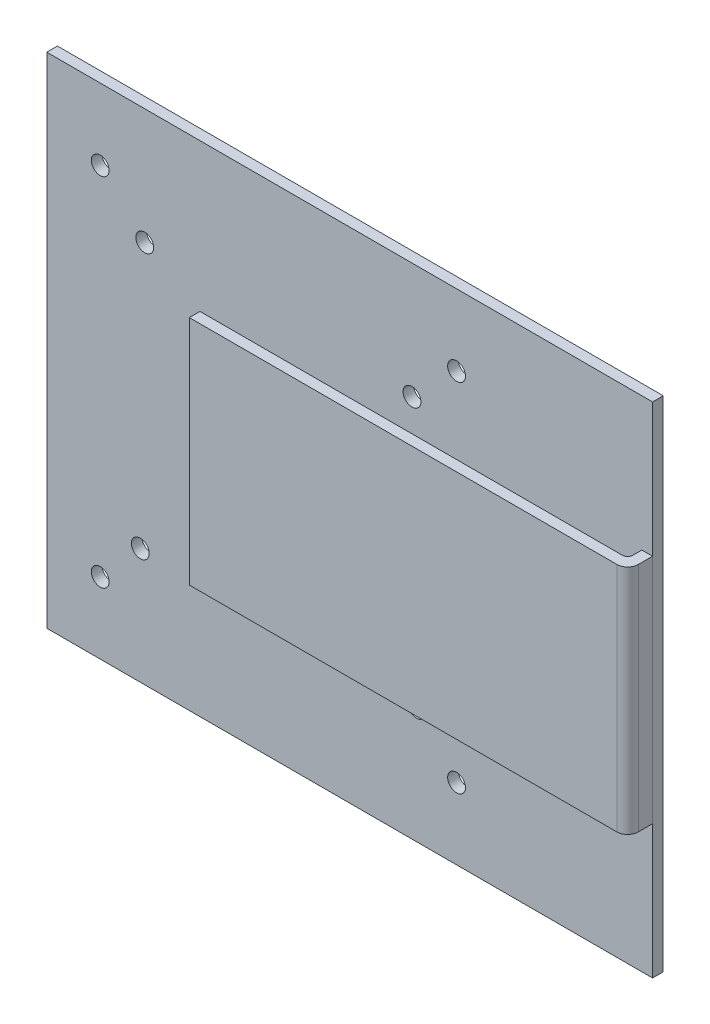
ISO-10303-21;
HEADER;
FILE_DESCRIPTION(('STEP AP214'),'2;1');
FILE_NAME('part.step','',(''),(''),'','','');
FILE_SCHEMA(('AUTOMOTIVE_DESIGN { 1 0 10303 214 1 1 1 1 }'));
ENDSEC;
DATA;
#1=APPLICATION_CONTEXT('core data for automotive mechanical design processes');
#2=APPLICATION_PROTOCOL_DEFINITION('international standard','automotive_design',2000,#1);
#3=PRODUCT_CONTEXT('',#1,'mechanical');
#4=PRODUCT('Part','Part','',(#3));
#5=PRODUCT_RELATED_PRODUCT_CATEGORY('part','',(#4));
#6=PRODUCT_DEFINITION_FORMATION('','',#4);
#7=PRODUCT_DEFINITION_CONTEXT('part definition',#1,'design');
#8=PRODUCT_DEFINITION('design','',#6,#7);
#9=PRODUCT_DEFINITION_SHAPE('','',#8);
#10=(LENGTH_UNIT() NAMED_UNIT(*) SI_UNIT(.MILLI.,.METRE.));
#11=(NAMED_UNIT(*) PLANE_ANGLE_UNIT() SI_UNIT($,.RADIAN.));
#12=(NAMED_UNIT(*) SI_UNIT($,.STERADIAN.) SOLID_ANGLE_UNIT());
#13=UNCERTAINTY_MEASURE_WITH_UNIT(LENGTH_MEASURE(1.E-05),#10,'distance_accuracy_value','');
#14=(GEOMETRIC_REPRESENTATION_CONTEXT(3) GLOBAL_UNCERTAINTY_ASSIGNED_CONTEXT((#13)) GLOBAL_UNIT_ASSIGNED_CONTEXT((#10,
#11,#12)) REPRESENTATION_CONTEXT('',''));
#15=CARTESIAN_POINT('',(0.,0.,0.));
#16=DIRECTION('',(0.,0.,1.));
#17=DIRECTION('',(1.,0.,0.));
#18=AXIS2_PLACEMENT_3D('',#15,#16,#17);
#19=CARTESIAN_POINT('',(102.,0.,0.));
#20=DIRECTION('',(1.,0.,0.));
#21=DIRECTION('',(0.,0.,-1.));
#22=AXIS2_PLACEMENT_3D('',#19,#20,#21);
#23=PLANE('',#22);
#24=DIRECTION('',(0.,0.,-1.));
#25=VECTOR('',#24,1.);
#26=CARTESIAN_POINT('',(102.,-32.5,7.));
#27=LINE('',#26,#25);
#28=CARTESIAN_POINT('',(102.,-32.5,2.50000000000001));
#29=VERTEX_POINT('',#28);
#30=CARTESIAN_POINT('',(102.,-32.5,0.));
#31=VERTEX_POINT('',#30);
#32=EDGE_CURVE('E147',#29,#31,#27,.T.);
#33=ORIENTED_EDGE('',*,*,#32,.F.);
#34=DIRECTION('',(0.,-1.,0.));
#35=VECTOR('',#34,1.);
#36=CARTESIAN_POINT('',(102.,32.5,2.5));
#37=LINE('',#36,#35);
#38=CARTESIAN_POINT('',(102.,32.5,2.5));
#39=VERTEX_POINT('',#38);
#40=EDGE_CURVE('E163',#29,#39,#37,.F.);
#41=ORIENTED_EDGE('',*,*,#40,.T.);
#42=DIRECTION('',(0.,0.,1.));
#43=VECTOR('',#42,1.);
#44=CARTESIAN_POINT('',(102.,32.5,0.));
#45=LINE('',#44,#43);
#46=CARTESIAN_POINT('',(102.,32.5,0.));
#47=VERTEX_POINT('',#46);
#48=EDGE_CURVE('E143',#47,#39,#45,.T.);
#49=ORIENTED_EDGE('',*,*,#48,.F.);
#50=DIRECTION('',(0.,1.,0.));
#51=VECTOR('',#50,1.);
#52=CARTESIAN_POINT('',(102.,-32.5,0.));
#53=LINE('',#52,#51);
#54=EDGE_CURVE('E141',#31,#47,#53,.T.);
#55=ORIENTED_EDGE('',*,*,#54,.F.);
#56=EDGE_LOOP('',(#33,#41,#49,#55));
#57=FACE_BOUND('',#56,.T.);
#58=ADVANCED_FACE('F48',(#57),#23,.F.);
#59=CARTESIAN_POINT('',(102.,-32.5,7.));
#60=DIRECTION('',(0.,-1.,0.));
#61=DIRECTION('',(1.,0.,0.));
#62=AXIS2_PLACEMENT_3D('',#59,#60,#61);
#63=PLANE('',#62);
#64=DIRECTION('',(0.,0.,-1.));
#65=VECTOR('',#64,1.);
#66=CARTESIAN_POINT('',(105.,-32.5,7.));
#67=LINE('',#66,#65);
#68=CARTESIAN_POINT('',(105.,-32.5,4.));
#69=VERTEX_POINT('',#68);
#70=CARTESIAN_POINT('',(105.,-32.5,0.));
#71=VERTEX_POINT('',#70);
#72=EDGE_CURVE('E144',#69,#71,#67,.T.);
#73=ORIENTED_EDGE('',*,*,#72,.F.);
#74=CARTESIAN_POINT('',(102.,-32.5,4.));
#75=DIRECTION('',(0.,-1.,0.));
#76=DIRECTION('',(1.,0.,0.));
#77=AXIS2_PLACEMENT_3D('',#74,#75,#76);
#78=CIRCLE('',#77,3.);
#79=CARTESIAN_POINT('',(102.,-32.5,7.));
#80=VERTEX_POINT('',#79);
#81=EDGE_CURVE('E70',#69,#80,#78,.T.);
#82=ORIENTED_EDGE('',*,*,#81,.T.);
#83=DIRECTION('',(1.,0.,0.));
#84=VECTOR('',#83,1.);
#85=CARTESIAN_POINT('',(102.,-32.5,7.));
#86=LINE('',#85,#84);
#87=CARTESIAN_POINT('',(-18.,-32.5,7.));
#88=VERTEX_POINT('',#87);
#89=EDGE_CURVE('E116',#88,#80,#86,.T.);
#90=ORIENTED_EDGE('',*,*,#89,.F.);
#91=DIRECTION('',(0.,0.,1.));
#92=VECTOR('',#91,1.);
#93=CARTESIAN_POINT('',(-18.,-32.5,7.));
#94=LINE('',#93,#92);
#95=CARTESIAN_POINT('',(-18.,-32.5,4.00000000000001));
#96=VERTEX_POINT('',#95);
#97=EDGE_CURVE('E131',#96,#88,#94,.T.);
#98=ORIENTED_EDGE('',*,*,#97,.F.);
#99=DIRECTION('',(1.,0.,0.));
#100=VECTOR('',#99,1.);
#101=CARTESIAN_POINT('',(-18.,-32.5,4.00000000000001));
#102=LINE('',#101,#100);
#103=CARTESIAN_POINT('',(100.5,-32.5,4.00000000000001));
#104=VERTEX_POINT('',#103);
#105=EDGE_CURVE('E136',#96,#104,#102,.T.);
#106=ORIENTED_EDGE('',*,*,#105,.T.);
#107=CARTESIAN_POINT('',(100.5,-32.5,2.50000000000001));
#108=DIRECTION('',(0.,-1.,0.));
#109=DIRECTION('',(1.,0.,0.));
#110=AXIS2_PLACEMENT_3D('',#107,#108,#109);
#111=CIRCLE('',#110,1.5);
#112=EDGE_CURVE('E165',#104,#29,#111,.F.);
#113=ORIENTED_EDGE('',*,*,#112,.T.);
#114=ORIENTED_EDGE('',*,*,#32,.T.);
#115=DIRECTION('',(1.,0.,0.));
#116=VECTOR('',#115,1.);
#117=CARTESIAN_POINT('',(102.,-32.5,0.));
#118=LINE('',#117,#116);
#119=EDGE_CURVE('E155',#31,#71,#118,.T.);
#120=ORIENTED_EDGE('',*,*,#119,.T.);
#121=EDGE_LOOP('',(#73,#82,#90,#98,#106,#113,#114,#120));
#122=FACE_BOUND('',#121,.T.);
#123=ADVANCED_FACE('F178',(#122),#63,.T.);
#124=CARTESIAN_POINT('',(102.,32.5,7.));
#125=DIRECTION('',(0.,0.,1.));
#126=DIRECTION('',(1.,0.,0.));
#127=AXIS2_PLACEMENT_3D('',#124,#125,#126);
#128=PLANE('',#127);
#129=ORIENTED_EDGE('',*,*,#89,.T.);
#130=DIRECTION('',(0.,-1.,0.));
#131=VECTOR('',#130,1.);
#132=CARTESIAN_POINT('',(102.,32.5,7.));
#133=LINE('',#132,#131);
#134=CARTESIAN_POINT('',(102.,32.5,7.));
#135=VERTEX_POINT('',#134);
#136=EDGE_CURVE('E56',#80,#135,#133,.F.);
#137=ORIENTED_EDGE('',*,*,#136,.T.);
#138=DIRECTION('',(1.,0.,0.));
#139=VECTOR('',#138,1.);
#140=CARTESIAN_POINT('',(102.,32.5,7.));
#141=LINE('',#140,#139);
#142=CARTESIAN_POINT('',(-18.,32.5,7.));
#143=VERTEX_POINT('',#142);
#144=EDGE_CURVE('E109',#143,#135,#141,.T.);
#145=ORIENTED_EDGE('',*,*,#144,.F.);
#146=DIRECTION('',(0.,1.,0.));
#147=VECTOR('',#146,1.);
#148=CARTESIAN_POINT('',(-18.,32.5,7.));
#149=LINE('',#148,#147);
#150=EDGE_CURVE('E113',#88,#143,#149,.T.);
#151=ORIENTED_EDGE('',*,*,#150,.F.);
#152=EDGE_LOOP('',(#129,#137,#145,#151));
#153=FACE_BOUND('',#152,.T.);
#154=ADVANCED_FACE('F111',(#153),#128,.T.);
#155=CARTESIAN_POINT('',(102.,32.5,0.));
#156=DIRECTION('',(0.,1.,0.));
#157=DIRECTION('',(-1.,0.,0.));
#158=AXIS2_PLACEMENT_3D('',#155,#156,#157);
#159=PLANE('',#158);
#160=ORIENTED_EDGE('',*,*,#144,.T.);
#161=CARTESIAN_POINT('',(102.,32.5,4.));
#162=DIRECTION('',(0.,1.,0.));
#163=DIRECTION('',(-1.,0.,0.));
#164=AXIS2_PLACEMENT_3D('',#161,#162,#163);
#165=CIRCLE('',#164,3.);
#166=CARTESIAN_POINT('',(105.,32.5,4.));
#167=VERTEX_POINT('',#166);
#168=EDGE_CURVE('E12',#135,#167,#165,.T.);
#169=ORIENTED_EDGE('',*,*,#168,.T.);
#170=DIRECTION('',(0.,0.,1.));
#171=VECTOR('',#170,1.);
#172=CARTESIAN_POINT('',(105.,32.5,0.));
#173=LINE('',#172,#171);
#174=CARTESIAN_POINT('',(105.,32.5,0.));
#175=VERTEX_POINT('',#174);
#176=EDGE_CURVE('E151',#175,#167,#173,.T.);
#177=ORIENTED_EDGE('',*,*,#176,.F.);
#178=DIRECTION('',(1.,0.,0.));
#179=VECTOR('',#178,1.);
#180=CARTESIAN_POINT('',(102.,32.5,0.));
#181=LINE('',#180,#179);
#182=EDGE_CURVE('E117',#47,#175,#181,.T.);
#183=ORIENTED_EDGE('',*,*,#182,.F.);
#184=ORIENTED_EDGE('',*,*,#48,.T.);
#185=CARTESIAN_POINT('',(100.5,32.5,2.5));
#186=DIRECTION('',(0.,1.,0.));
#187=DIRECTION('',(-1.,0.,0.));
#188=AXIS2_PLACEMENT_3D('',#185,#186,#187);
#189=CIRCLE('',#188,1.5);
#190=CARTESIAN_POINT('',(100.5,32.5,4.));
#191=VERTEX_POINT('',#190);
#192=EDGE_CURVE('E167',#39,#191,#189,.F.);
#193=ORIENTED_EDGE('',*,*,#192,.T.);
#194=DIRECTION('',(1.,0.,0.));
#195=VECTOR('',#194,1.);
#196=CARTESIAN_POINT('',(-18.,32.5,4.));
#197=LINE('',#196,#195);
#198=CARTESIAN_POINT('',(-18.,32.5,4.));
#199=VERTEX_POINT('',#198);
#200=EDGE_CURVE('E123',#199,#191,#197,.T.);
#201=ORIENTED_EDGE('',*,*,#200,.F.);
#202=DIRECTION('',(0.,0.,-1.));
#203=VECTOR('',#202,1.);
#204=CARTESIAN_POINT('',(-18.,32.5,7.));
#205=LINE('',#204,#203);
#206=EDGE_CURVE('E120',#143,#199,#205,.T.);
#207=ORIENTED_EDGE('',*,*,#206,.F.);
#208=EDGE_LOOP('',(#160,#169,#177,#183,#184,#193,#201,#207));
#209=FACE_BOUND('',#208,.T.);
#210=ADVANCED_FACE('F121',(#209),#159,.T.);
#211=CARTESIAN_POINT('',(102.,0.,0.));
#212=DIRECTION('',(0.,0.,-1.));
#213=DIRECTION('',(-1.,0.,0.));
#214=AXIS2_PLACEMENT_3D('',#211,#212,#213);
#215=PLANE('',#214);
#216=DIRECTION('',(0.,1.,0.));
#217=VECTOR('',#216,1.);
#218=CARTESIAN_POINT('',(105.,0.,0.));
#219=LINE('',#218,#217);
#220=EDGE_CURVE('E140',#71,#175,#219,.T.);
#221=ORIENTED_EDGE('',*,*,#220,.F.);
#222=ORIENTED_EDGE('',*,*,#119,.F.);
#223=ORIENTED_EDGE('',*,*,#54,.T.);
#224=ORIENTED_EDGE('',*,*,#182,.T.);
#225=EDGE_LOOP('',(#221,#222,#223,#224));
#226=FACE_BOUND('',#225,.T.);
#227=ADVANCED_FACE('F183',(#226),#215,.T.);
#228=CARTESIAN_POINT('',(105.,0.,0.));
#229=DIRECTION('',(1.,0.,0.));
#230=DIRECTION('',(0.,0.,-1.));
#231=AXIS2_PLACEMENT_3D('',#228,#229,#230);
#232=PLANE('',#231);
#233=ORIENTED_EDGE('',*,*,#176,.T.);
#234=DIRECTION('',(0.,-1.,0.));
#235=VECTOR('',#234,1.);
#236=CARTESIAN_POINT('',(105.,0.,4.));
#237=LINE('',#236,#235);
#238=EDGE_CURVE('E169',#167,#69,#237,.T.);
#239=ORIENTED_EDGE('',*,*,#238,.T.);
#240=ORIENTED_EDGE('',*,*,#72,.T.);
#241=ORIENTED_EDGE('',*,*,#220,.T.);
#242=EDGE_LOOP('',(#233,#239,#240,#241));
#243=FACE_BOUND('',#242,.T.);
#244=ADVANCED_FACE('F174',(#243),#232,.T.);
#245=CARTESIAN_POINT('',(-18.,32.5,4.));
#246=DIRECTION('',(0.,0.,1.));
#247=DIRECTION('',(0.,-1.,0.));
#248=AXIS2_PLACEMENT_3D('',#245,#246,#247);
#249=PLANE('',#248);
#250=ORIENTED_EDGE('',*,*,#200,.T.);
#251=DIRECTION('',(0.,-1.,0.));
#252=VECTOR('',#251,1.);
#253=CARTESIAN_POINT('',(100.5,-32.5,4.00000000000001));
#254=LINE('',#253,#252);
#255=EDGE_CURVE('E158',#191,#104,#254,.T.);
#256=ORIENTED_EDGE('',*,*,#255,.T.);
#257=ORIENTED_EDGE('',*,*,#105,.F.);
#258=DIRECTION('',(0.,-1.,0.));
#259=VECTOR('',#258,1.);
#260=CARTESIAN_POINT('',(-18.,32.5,4.));
#261=LINE('',#260,#259);
#262=EDGE_CURVE('E126',#199,#96,#261,.T.);
#263=ORIENTED_EDGE('',*,*,#262,.F.);
#264=EDGE_LOOP('',(#250,#256,#257,#263));
#265=FACE_BOUND('',#264,.T.);
#266=ADVANCED_FACE('F194',(#265),#249,.F.);
#267=CARTESIAN_POINT('',(-18.,0.,0.));
#268=DIRECTION('',(1.,0.,0.));
#269=DIRECTION('',(0.,0.,-1.));
#270=AXIS2_PLACEMENT_3D('',#267,#268,#269);
#271=PLANE('',#270);
#272=ORIENTED_EDGE('',*,*,#150,.T.);
#273=ORIENTED_EDGE('',*,*,#206,.T.);
#274=ORIENTED_EDGE('',*,*,#262,.T.);
#275=ORIENTED_EDGE('',*,*,#97,.T.);
#276=EDGE_LOOP('',(#272,#273,#274,#275));
#277=FACE_BOUND('',#276,.T.);
#278=ADVANCED_FACE('F129',(#277),#271,.F.);
#279=CARTESIAN_POINT('',(100.5,32.5,2.5));
#280=DIRECTION('',(0.,1.,0.));
#281=DIRECTION('',(0.,0.,1.));
#282=AXIS2_PLACEMENT_3D('',#279,#280,#281);
#283=CYLINDRICAL_SURFACE('',#282,1.5);
#284=ORIENTED_EDGE('',*,*,#192,.F.);
#285=ORIENTED_EDGE('',*,*,#40,.F.);
#286=ORIENTED_EDGE('',*,*,#112,.F.);
#287=ORIENTED_EDGE('',*,*,#255,.F.);
#288=EDGE_LOOP('',(#284,#285,#286,#287));
#289=FACE_BOUND('',#288,.T.);
#290=ADVANCED_FACE('F191',(#289),#283,.F.);
#291=CARTESIAN_POINT('',(102.,0.,4.));
#292=DIRECTION('',(0.,-1.,0.));
#293=DIRECTION('',(0.,0.,-1.));
#294=AXIS2_PLACEMENT_3D('',#291,#292,#293);
#295=CYLINDRICAL_SURFACE('',#294,3.);
#296=ORIENTED_EDGE('',*,*,#168,.F.);
#297=ORIENTED_EDGE('',*,*,#136,.F.);
#298=ORIENTED_EDGE('',*,*,#81,.F.);
#299=ORIENTED_EDGE('',*,*,#238,.F.);
#300=EDGE_LOOP('',(#296,#297,#298,#299));
#301=FACE_BOUND('',#300,.T.);
#302=ADVANCED_FACE('F50',(#301),#295,.T.);
#303=CLOSED_SHELL('',(#58,#123,#154,#210,#227,#244,#266,#278,#290,#302));
#304=MANIFOLD_SOLID_BREP('B2',#303);
#305=CARTESIAN_POINT('',(0.,0.,0.));
#306=DIRECTION('',(0.,0.,-1.));
#307=DIRECTION('',(-1.,0.,0.));
#308=AXIS2_PLACEMENT_3D('',#305,#306,#307);
#309=PLANE('',#308);
#310=CARTESIAN_POINT('',(-50.,-50.,0.));
#311=DIRECTION('',(0.,0.,1.));
#312=DIRECTION('',(1.,0.,0.));
#313=AXIS2_PLACEMENT_3D('',#310,#311,#312);
#314=CIRCLE('',#313,2.5);
#315=CARTESIAN_POINT('',(-47.5,-50.,0.));
#316=VERTEX_POINT('',#315);
#317=EDGE_CURVE('E374',#316,#316,#314,.T.);
#318=ORIENTED_EDGE('',*,*,#317,.F.);
#319=EDGE_LOOP('',(#318));
#320=FACE_BOUND('',#319,.T.);
#321=CARTESIAN_POINT('',(-37.5,37.5,0.));
#322=DIRECTION('',(0.,0.,1.));
#323=DIRECTION('',(1.,0.,0.));
#324=AXIS2_PLACEMENT_3D('',#321,#322,#323);
#325=CIRCLE('',#324,2.5);
#326=CARTESIAN_POINT('',(-35.,37.5,0.));
#327=VERTEX_POINT('',#326);
#328=EDGE_CURVE('E365',#327,#327,#325,.T.);
#329=ORIENTED_EDGE('',*,*,#328,.F.);
#330=EDGE_LOOP('',(#329));
#331=FACE_BOUND('',#330,.T.);
#332=CARTESIAN_POINT('',(38.7517490608709,-37.4895534343859,0.));
#333=DIRECTION('',(0.,0.,1.));
#334=DIRECTION('',(1.,0.,0.));
#335=AXIS2_PLACEMENT_3D('',#332,#333,#334);
#336=CIRCLE('',#335,2.5);
#337=CARTESIAN_POINT('',(41.2517490608709,-37.4895534343859,0.));
#338=VERTEX_POINT('',#337);
#339=EDGE_CURVE('E364',#338,#338,#336,.T.);
#340=ORIENTED_EDGE('',*,*,#339,.F.);
#341=EDGE_LOOP('',(#340));
#342=FACE_BOUND('',#341,.T.);
#343=CARTESIAN_POINT('',(-38.751749060871,-37.4895534343859,0.));
#344=DIRECTION('',(0.,0.,1.));
#345=DIRECTION('',(1.,0.,0.));
#346=AXIS2_PLACEMENT_3D('',#343,#344,#345);
#347=CIRCLE('',#346,2.5);
#348=CARTESIAN_POINT('',(-36.251749060871,-37.4895534343859,0.));
#349=VERTEX_POINT('',#348);
#350=EDGE_CURVE('E361',#349,#349,#347,.T.);
#351=ORIENTED_EDGE('',*,*,#350,.F.);
#352=EDGE_LOOP('',(#351));
#353=FACE_BOUND('',#352,.T.);
#354=CARTESIAN_POINT('',(37.5,37.5,0.));
#355=DIRECTION('',(0.,0.,1.));
#356=DIRECTION('',(1.,0.,0.));
#357=AXIS2_PLACEMENT_3D('',#354,#355,#356);
#358=CIRCLE('',#357,2.5);
#359=CARTESIAN_POINT('',(40.,37.5,0.));
#360=VERTEX_POINT('',#359);
#361=EDGE_CURVE('E368',#360,#360,#358,.T.);
#362=ORIENTED_EDGE('',*,*,#361,.F.);
#363=EDGE_LOOP('',(#362));
#364=FACE_BOUND('',#363,.T.);
#365=CARTESIAN_POINT('',(50.,-50.,0.));
#366=DIRECTION('',(0.,0.,1.));
#367=DIRECTION('',(1.,0.,0.));
#368=AXIS2_PLACEMENT_3D('',#365,#366,#367);
#369=CIRCLE('',#368,2.5);
#370=CARTESIAN_POINT('',(52.5,-50.,0.));
#371=VERTEX_POINT('',#370);
#372=EDGE_CURVE('E378',#371,#371,#369,.T.);
#373=ORIENTED_EDGE('',*,*,#372,.F.);
#374=EDGE_LOOP('',(#373));
#375=FACE_BOUND('',#374,.T.);
#376=CARTESIAN_POINT('',(50.,50.,0.));
#377=DIRECTION('',(0.,0.,1.));
#378=DIRECTION('',(1.,0.,0.));
#379=AXIS2_PLACEMENT_3D('',#376,#377,#378);
#380=CIRCLE('',#379,2.5);
#381=CARTESIAN_POINT('',(52.5,50.,0.));
#382=VERTEX_POINT('',#381);
#383=EDGE_CURVE('E375',#382,#382,#380,.T.);
#384=ORIENTED_EDGE('',*,*,#383,.F.);
#385=EDGE_LOOP('',(#384));
#386=FACE_BOUND('',#385,.T.);
#387=CARTESIAN_POINT('',(-50.,50.,0.));
#388=DIRECTION('',(0.,0.,1.));
#389=DIRECTION('',(1.,0.,0.));
#390=AXIS2_PLACEMENT_3D('',#387,#388,#389);
#391=CIRCLE('',#390,2.5);
#392=CARTESIAN_POINT('',(-47.5,50.,0.));
#393=VERTEX_POINT('',#392);
#394=EDGE_CURVE('E371',#393,#393,#391,.T.);
#395=ORIENTED_EDGE('',*,*,#394,.F.);
#396=EDGE_LOOP('',(#395));
#397=FACE_BOUND('',#396,.T.);
#398=DIRECTION('',(0.,-1.,0.));
#399=VECTOR('',#398,1.);
#400=CARTESIAN_POINT('',(-65.,65.,0.));
#401=LINE('',#400,#399);
#402=CARTESIAN_POINT('',(-65.,70.,0.));
#403=VERTEX_POINT('',#402);
#404=CARTESIAN_POINT('',(-65.,-70.,0.));
#405=VERTEX_POINT('',#404);
#406=EDGE_CURVE('E333',#403,#405,#401,.T.);
#407=ORIENTED_EDGE('',*,*,#406,.T.);
#408=DIRECTION('',(-1.,0.,0.));
#409=VECTOR('',#408,1.);
#410=CARTESIAN_POINT('',(105.,-70.,0.));
#411=LINE('',#410,#409);
#412=CARTESIAN_POINT('',(105.,-70.,0.));
#413=VERTEX_POINT('',#412);
#414=EDGE_CURVE('E352',#413,#405,#411,.T.);
#415=ORIENTED_EDGE('',*,*,#414,.F.);
#416=DIRECTION('',(0.,1.,0.));
#417=VECTOR('',#416,1.);
#418=CARTESIAN_POINT('',(105.,65.,0.));
#419=LINE('',#418,#417);
#420=CARTESIAN_POINT('',(105.,70.,0.));
#421=VERTEX_POINT('',#420);
#422=EDGE_CURVE('E334',#413,#421,#419,.T.);
#423=ORIENTED_EDGE('',*,*,#422,.T.);
#424=DIRECTION('',(1.,0.,0.));
#425=VECTOR('',#424,1.);
#426=CARTESIAN_POINT('',(105.,70.,0.));
#427=LINE('',#426,#425);
#428=EDGE_CURVE('E346',#403,#421,#427,.T.);
#429=ORIENTED_EDGE('',*,*,#428,.F.);
#430=EDGE_LOOP('',(#407,#415,#423,#429));
#431=FACE_BOUND('',#430,.T.);
#432=ADVANCED_FACE('F288',(#320,#331,#342,#353,#364,#375,#386,#397,#431),#309,.F.);
#433=CARTESIAN_POINT('',(0.,0.,-3.));
#434=DIRECTION('',(0.,0.,-1.));
#435=DIRECTION('',(-1.,0.,0.));
#436=AXIS2_PLACEMENT_3D('',#433,#434,#435);
#437=PLANE('',#436);
#438=CARTESIAN_POINT('',(-50.,-50.,-3.));
#439=DIRECTION('',(0.,0.,-1.));
#440=DIRECTION('',(-1.,0.,0.));
#441=AXIS2_PLACEMENT_3D('',#438,#439,#440);
#442=CIRCLE('',#441,2.5);
#443=CARTESIAN_POINT('',(-52.5,-50.,-3.));
#444=VERTEX_POINT('',#443);
#445=EDGE_CURVE('E385',#444,#444,#442,.T.);
#446=ORIENTED_EDGE('',*,*,#445,.F.);
#447=EDGE_LOOP('',(#446));
#448=FACE_BOUND('',#447,.T.);
#449=CARTESIAN_POINT('',(-37.5,37.5,-3.));
#450=DIRECTION('',(0.,0.,-1.));
#451=DIRECTION('',(-1.,0.,0.));
#452=AXIS2_PLACEMENT_3D('',#449,#450,#451);
#453=CIRCLE('',#452,2.5);
#454=CARTESIAN_POINT('',(-40.,37.5,-3.));
#455=VERTEX_POINT('',#454);
#456=EDGE_CURVE('E388',#455,#455,#453,.T.);
#457=ORIENTED_EDGE('',*,*,#456,.F.);
#458=EDGE_LOOP('',(#457));
#459=FACE_BOUND('',#458,.T.);
#460=CARTESIAN_POINT('',(38.7517490608709,-37.4895534343859,-3.));
#461=DIRECTION('',(0.,0.,-1.));
#462=DIRECTION('',(-1.,0.,0.));
#463=AXIS2_PLACEMENT_3D('',#460,#461,#462);
#464=CIRCLE('',#463,2.5);
#465=CARTESIAN_POINT('',(36.2517490608709,-37.4895534343859,-3.));
#466=VERTEX_POINT('',#465);
#467=EDGE_CURVE('E391',#466,#466,#464,.T.);
#468=ORIENTED_EDGE('',*,*,#467,.F.);
#469=EDGE_LOOP('',(#468));
#470=FACE_BOUND('',#469,.T.);
#471=CARTESIAN_POINT('',(-38.751749060871,-37.4895534343859,-3.));
#472=DIRECTION('',(0.,0.,-1.));
#473=DIRECTION('',(-1.,0.,0.));
#474=AXIS2_PLACEMENT_3D('',#471,#472,#473);
#475=CIRCLE('',#474,2.5);
#476=CARTESIAN_POINT('',(-41.251749060871,-37.4895534343859,-3.));
#477=VERTEX_POINT('',#476);
#478=EDGE_CURVE('E394',#477,#477,#475,.T.);
#479=ORIENTED_EDGE('',*,*,#478,.F.);
#480=EDGE_LOOP('',(#479));
#481=FACE_BOUND('',#480,.T.);
#482=CARTESIAN_POINT('',(37.5,37.5,-3.));
#483=DIRECTION('',(0.,0.,-1.));
#484=DIRECTION('',(-1.,0.,0.));
#485=AXIS2_PLACEMENT_3D('',#482,#483,#484);
#486=CIRCLE('',#485,2.5);
#487=CARTESIAN_POINT('',(35.,37.5,-3.));
#488=VERTEX_POINT('',#487);
#489=EDGE_CURVE('E397',#488,#488,#486,.T.);
#490=ORIENTED_EDGE('',*,*,#489,.F.);
#491=EDGE_LOOP('',(#490));
#492=FACE_BOUND('',#491,.T.);
#493=CARTESIAN_POINT('',(50.,-50.,-3.));
#494=DIRECTION('',(0.,0.,-1.));
#495=DIRECTION('',(-1.,0.,0.));
#496=AXIS2_PLACEMENT_3D('',#493,#494,#495);
#497=CIRCLE('',#496,2.5);
#498=CARTESIAN_POINT('',(47.5,-50.,-3.));
#499=VERTEX_POINT('',#498);
#500=EDGE_CURVE('E400',#499,#499,#497,.T.);
#501=ORIENTED_EDGE('',*,*,#500,.F.);
#502=EDGE_LOOP('',(#501));
#503=FACE_BOUND('',#502,.T.);
#504=CARTESIAN_POINT('',(50.,50.,-3.));
#505=DIRECTION('',(0.,0.,-1.));
#506=DIRECTION('',(-1.,0.,0.));
#507=AXIS2_PLACEMENT_3D('',#504,#505,#506);
#508=CIRCLE('',#507,2.5);
#509=CARTESIAN_POINT('',(47.5,50.,-3.));
#510=VERTEX_POINT('',#509);
#511=EDGE_CURVE('E403',#510,#510,#508,.T.);
#512=ORIENTED_EDGE('',*,*,#511,.F.);
#513=EDGE_LOOP('',(#512));
#514=FACE_BOUND('',#513,.T.);
#515=CARTESIAN_POINT('',(-50.,50.,-3.));
#516=DIRECTION('',(0.,0.,-1.));
#517=DIRECTION('',(-1.,0.,0.));
#518=AXIS2_PLACEMENT_3D('',#515,#516,#517);
#519=CIRCLE('',#518,2.5);
#520=CARTESIAN_POINT('',(-52.5,50.,-3.));
#521=VERTEX_POINT('',#520);
#522=EDGE_CURVE('E295',#521,#521,#519,.T.);
#523=ORIENTED_EDGE('',*,*,#522,.F.);
#524=EDGE_LOOP('',(#523));
#525=FACE_BOUND('',#524,.T.);
#526=DIRECTION('',(0.,1.,0.));
#527=VECTOR('',#526,1.);
#528=CARTESIAN_POINT('',(-65.,0.,-3.));
#529=LINE('',#528,#527);
#530=CARTESIAN_POINT('',(-65.,-70.,-3.));
#531=VERTEX_POINT('',#530);
#532=CARTESIAN_POINT('',(-65.,70.,-3.));
#533=VERTEX_POINT('',#532);
#534=EDGE_CURVE('E46',#531,#533,#529,.T.);
#535=ORIENTED_EDGE('',*,*,#534,.T.);
#536=DIRECTION('',(-1.,0.,0.));
#537=VECTOR('',#536,1.);
#538=CARTESIAN_POINT('',(105.,70.,-3.));
#539=LINE('',#538,#537);
#540=CARTESIAN_POINT('',(105.,70.,-3.));
#541=VERTEX_POINT('',#540);
#542=EDGE_CURVE('E337',#541,#533,#539,.T.);
#543=ORIENTED_EDGE('',*,*,#542,.F.);
#544=DIRECTION('',(0.,1.,0.));
#545=VECTOR('',#544,1.);
#546=CARTESIAN_POINT('',(105.,65.,-3.));
#547=LINE('',#546,#545);
#548=CARTESIAN_POINT('',(105.,-70.,-3.));
#549=VERTEX_POINT('',#548);
#550=EDGE_CURVE('E302',#549,#541,#547,.T.);
#551=ORIENTED_EDGE('',*,*,#550,.F.);
#552=DIRECTION('',(1.,0.,0.));
#553=VECTOR('',#552,1.);
#554=CARTESIAN_POINT('',(105.,-70.,-3.));
#555=LINE('',#554,#553);
#556=EDGE_CURVE('E357',#531,#549,#555,.T.);
#557=ORIENTED_EDGE('',*,*,#556,.F.);
#558=EDGE_LOOP('',(#535,#543,#551,#557));
#559=FACE_BOUND('',#558,.T.);
#560=ADVANCED_FACE('F338',(#448,#459,#470,#481,#492,#503,#514,#525,#559),#437,.T.);
#561=CARTESIAN_POINT('',(-50.,-50.,-20.));
#562=DIRECTION('',(0.,0.,1.));
#563=DIRECTION('',(1.,0.,0.));
#564=AXIS2_PLACEMENT_3D('',#561,#562,#563);
#565=CYLINDRICAL_SURFACE('',#564,2.5);
#566=ORIENTED_EDGE('',*,*,#445,.T.);
#567=EDGE_LOOP('',(#566));
#568=FACE_BOUND('',#567,.T.);
#569=ORIENTED_EDGE('',*,*,#317,.T.);
#570=EDGE_LOOP('',(#569));
#571=FACE_BOUND('',#570,.T.);
#572=ADVANCED_FACE('F412',(#568,#571),#565,.F.);
#573=CARTESIAN_POINT('',(-37.5,37.5,-20.));
#574=DIRECTION('',(0.,0.,1.));
#575=DIRECTION('',(1.,0.,0.));
#576=AXIS2_PLACEMENT_3D('',#573,#574,#575);
#577=CYLINDRICAL_SURFACE('',#576,2.5);
#578=ORIENTED_EDGE('',*,*,#456,.T.);
#579=EDGE_LOOP('',(#578));
#580=FACE_BOUND('',#579,.T.);
#581=ORIENTED_EDGE('',*,*,#328,.T.);
#582=EDGE_LOOP('',(#581));
#583=FACE_BOUND('',#582,.T.);
#584=ADVANCED_FACE('F418',(#580,#583),#577,.F.);
#585=CARTESIAN_POINT('',(38.7517490608709,-37.4895534343859,-20.));
#586=DIRECTION('',(0.,0.,1.));
#587=DIRECTION('',(1.,0.,0.));
#588=AXIS2_PLACEMENT_3D('',#585,#586,#587);
#589=CYLINDRICAL_SURFACE('',#588,2.5);
#590=ORIENTED_EDGE('',*,*,#467,.T.);
#591=EDGE_LOOP('',(#590));
#592=FACE_BOUND('',#591,.T.);
#593=ORIENTED_EDGE('',*,*,#339,.T.);
#594=EDGE_LOOP('',(#593));
#595=FACE_BOUND('',#594,.T.);
#596=ADVANCED_FACE('F441',(#592,#595),#589,.F.);
#597=CARTESIAN_POINT('',(-38.751749060871,-37.4895534343859,-20.));
#598=DIRECTION('',(0.,0.,1.));
#599=DIRECTION('',(1.,0.,0.));
#600=AXIS2_PLACEMENT_3D('',#597,#598,#599);
#601=CYLINDRICAL_SURFACE('',#600,2.5);
#602=ORIENTED_EDGE('',*,*,#478,.T.);
#603=EDGE_LOOP('',(#602));
#604=FACE_BOUND('',#603,.T.);
#605=ORIENTED_EDGE('',*,*,#350,.T.);
#606=EDGE_LOOP('',(#605));
#607=FACE_BOUND('',#606,.T.);
#608=ADVANCED_FACE('F429',(#604,#607),#601,.F.);
#609=CARTESIAN_POINT('',(37.5,37.5,-20.));
#610=DIRECTION('',(0.,0.,1.));
#611=DIRECTION('',(1.,0.,0.));
#612=AXIS2_PLACEMENT_3D('',#609,#610,#611);
#613=CYLINDRICAL_SURFACE('',#612,2.5);
#614=ORIENTED_EDGE('',*,*,#489,.T.);
#615=EDGE_LOOP('',(#614));
#616=FACE_BOUND('',#615,.T.);
#617=ORIENTED_EDGE('',*,*,#361,.T.);
#618=EDGE_LOOP('',(#617));
#619=FACE_BOUND('',#618,.T.);
#620=ADVANCED_FACE('F425',(#616,#619),#613,.F.);
#621=CARTESIAN_POINT('',(50.,-50.,-20.));
#622=DIRECTION('',(0.,0.,1.));
#623=DIRECTION('',(1.,0.,0.));
#624=AXIS2_PLACEMENT_3D('',#621,#622,#623);
#625=CYLINDRICAL_SURFACE('',#624,2.5);
#626=ORIENTED_EDGE('',*,*,#500,.T.);
#627=EDGE_LOOP('',(#626));
#628=FACE_BOUND('',#627,.T.);
#629=ORIENTED_EDGE('',*,*,#372,.T.);
#630=EDGE_LOOP('',(#629));
#631=FACE_BOUND('',#630,.T.);
#632=ADVANCED_FACE('F428',(#628,#631),#625,.F.);
#633=CARTESIAN_POINT('',(50.,50.,-20.));
#634=DIRECTION('',(0.,0.,1.));
#635=DIRECTION('',(1.,0.,0.));
#636=AXIS2_PLACEMENT_3D('',#633,#634,#635);
#637=CYLINDRICAL_SURFACE('',#636,2.5);
#638=ORIENTED_EDGE('',*,*,#511,.T.);
#639=EDGE_LOOP('',(#638));
#640=FACE_BOUND('',#639,.T.);
#641=ORIENTED_EDGE('',*,*,#383,.T.);
#642=EDGE_LOOP('',(#641));
#643=FACE_BOUND('',#642,.T.);
#644=ADVANCED_FACE('F433',(#640,#643),#637,.F.);
#645=CARTESIAN_POINT('',(-50.,50.,-20.));
#646=DIRECTION('',(0.,0.,1.));
#647=DIRECTION('',(1.,0.,0.));
#648=AXIS2_PLACEMENT_3D('',#645,#646,#647);
#649=CYLINDRICAL_SURFACE('',#648,2.5);
#650=ORIENTED_EDGE('',*,*,#522,.T.);
#651=EDGE_LOOP('',(#650));
#652=FACE_BOUND('',#651,.T.);
#653=ORIENTED_EDGE('',*,*,#394,.T.);
#654=EDGE_LOOP('',(#653));
#655=FACE_BOUND('',#654,.T.);
#656=ADVANCED_FACE('F408',(#652,#655),#649,.F.);
#657=CARTESIAN_POINT('',(-65.,65.,-20.));
#658=DIRECTION('',(-1.,0.,0.));
#659=DIRECTION('',(0.,0.,1.));
#660=AXIS2_PLACEMENT_3D('',#657,#658,#659);
#661=PLANE('',#660);
#662=ORIENTED_EDGE('',*,*,#534,.F.);
#663=DIRECTION('',(0.,0.,-1.));
#664=VECTOR('',#663,1.);
#665=CARTESIAN_POINT('',(-65.,-70.,0.));
#666=LINE('',#665,#664);
#667=EDGE_CURVE('E355',#405,#531,#666,.T.);
#668=ORIENTED_EDGE('',*,*,#667,.F.);
#669=ORIENTED_EDGE('',*,*,#406,.F.);
#670=DIRECTION('',(0.,0.,1.));
#671=VECTOR('',#670,1.);
#672=CARTESIAN_POINT('',(-65.,70.,-3.));
#673=LINE('',#672,#671);
#674=EDGE_CURVE('E341',#533,#403,#673,.T.);
#675=ORIENTED_EDGE('',*,*,#674,.F.);
#676=EDGE_LOOP('',(#662,#668,#669,#675));
#677=FACE_BOUND('',#676,.T.);
#678=ADVANCED_FACE('F440',(#677),#661,.T.);
#679=CARTESIAN_POINT('',(105.,65.,-3.));
#680=DIRECTION('',(1.,0.,0.));
#681=DIRECTION('',(0.,1.,0.));
#682=AXIS2_PLACEMENT_3D('',#679,#680,#681);
#683=PLANE('',#682);
#684=ORIENTED_EDGE('',*,*,#422,.F.);
#685=DIRECTION('',(0.,0.,1.));
#686=VECTOR('',#685,1.);
#687=CARTESIAN_POINT('',(105.,-70.,0.));
#688=LINE('',#687,#686);
#689=EDGE_CURVE('E332',#549,#413,#688,.T.);
#690=ORIENTED_EDGE('',*,*,#689,.F.);
#691=ORIENTED_EDGE('',*,*,#550,.T.);
#692=DIRECTION('',(0.,0.,-1.));
#693=VECTOR('',#692,1.);
#694=CARTESIAN_POINT('',(105.,70.,-3.));
#695=LINE('',#694,#693);
#696=EDGE_CURVE('E330',#421,#541,#695,.T.);
#697=ORIENTED_EDGE('',*,*,#696,.F.);
#698=EDGE_LOOP('',(#684,#690,#691,#697));
#699=FACE_BOUND('',#698,.T.);
#700=ADVANCED_FACE('F328',(#699),#683,.T.);
#701=CARTESIAN_POINT('',(0.,-70.,0.));
#702=DIRECTION('',(0.,1.,0.));
#703=DIRECTION('',(0.,0.,1.));
#704=AXIS2_PLACEMENT_3D('',#701,#702,#703);
#705=PLANE('',#704);
#706=ORIENTED_EDGE('',*,*,#689,.T.);
#707=ORIENTED_EDGE('',*,*,#414,.T.);
#708=ORIENTED_EDGE('',*,*,#667,.T.);
#709=ORIENTED_EDGE('',*,*,#556,.T.);
#710=EDGE_LOOP('',(#706,#707,#708,#709));
#711=FACE_BOUND('',#710,.T.);
#712=ADVANCED_FACE('F455',(#711),#705,.F.);
#713=CARTESIAN_POINT('',(0.,70.,0.));
#714=DIRECTION('',(0.,-1.,0.));
#715=DIRECTION('',(0.,0.,-1.));
#716=AXIS2_PLACEMENT_3D('',#713,#714,#715);
#717=PLANE('',#716);
#718=ORIENTED_EDGE('',*,*,#696,.T.);
#719=ORIENTED_EDGE('',*,*,#542,.T.);
#720=ORIENTED_EDGE('',*,*,#674,.T.);
#721=ORIENTED_EDGE('',*,*,#428,.T.);
#722=EDGE_LOOP('',(#718,#719,#720,#721));
#723=FACE_BOUND('',#722,.T.);
#724=ADVANCED_FACE('F344',(#723),#717,.F.);
#725=CLOSED_SHELL('',(#432,#560,#572,#584,#596,#608,#620,#632,#644,#656,#678,#700,#712,#724));
#726=MANIFOLD_SOLID_BREP('B6',#725);
#727=ADVANCED_BREP_SHAPE_REPRESENTATION('',(#18,#304,#726),#14);
#728=SHAPE_DEFINITION_REPRESENTATION(#9,#727);
ENDSEC;
END-ISO-10303-21;
